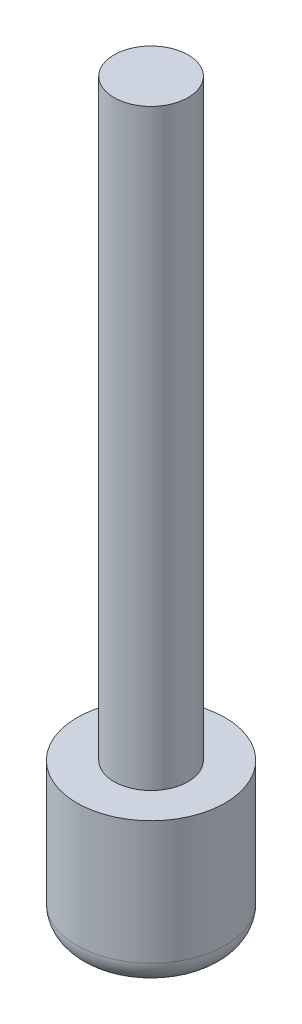
ISO-10303-21;
HEADER;
FILE_DESCRIPTION(('STEP AP214'),'2;1');
FILE_NAME('part.step','',(''),(''),'','','');
FILE_SCHEMA(('AUTOMOTIVE_DESIGN { 1 0 10303 214 1 1 1 1 }'));
ENDSEC;
DATA;
#1=APPLICATION_CONTEXT('core data for automotive mechanical design processes');
#2=APPLICATION_PROTOCOL_DEFINITION('international standard','automotive_design',2000,#1);
#3=PRODUCT_CONTEXT('',#1,'mechanical');
#4=PRODUCT('Part','Part','',(#3));
#5=PRODUCT_RELATED_PRODUCT_CATEGORY('part','',(#4));
#6=PRODUCT_DEFINITION_FORMATION('','',#4);
#7=PRODUCT_DEFINITION_CONTEXT('part definition',#1,'design');
#8=PRODUCT_DEFINITION('design','',#6,#7);
#9=PRODUCT_DEFINITION_SHAPE('','',#8);
#10=(LENGTH_UNIT() NAMED_UNIT(*) SI_UNIT(.MILLI.,.METRE.));
#11=(NAMED_UNIT(*) PLANE_ANGLE_UNIT() SI_UNIT($,.RADIAN.));
#12=(NAMED_UNIT(*) SI_UNIT($,.STERADIAN.) SOLID_ANGLE_UNIT());
#13=UNCERTAINTY_MEASURE_WITH_UNIT(LENGTH_MEASURE(1.E-05),#10,'distance_accuracy_value','');
#14=(GEOMETRIC_REPRESENTATION_CONTEXT(3) GLOBAL_UNCERTAINTY_ASSIGNED_CONTEXT((#13)) GLOBAL_UNIT_ASSIGNED_CONTEXT((#10,
#11,#12)) REPRESENTATION_CONTEXT('',''));
#15=CARTESIAN_POINT('',(0.,0.,0.));
#16=DIRECTION('',(0.,0.,1.));
#17=DIRECTION('',(1.,0.,0.));
#18=AXIS2_PLACEMENT_3D('',#15,#16,#17);
#19=CARTESIAN_POINT('',(0.,0.,0.));
#20=DIRECTION('',(0.,-1.,0.));
#21=DIRECTION('',(0.,0.,-1.));
#22=AXIS2_PLACEMENT_3D('',#19,#20,#21);
#23=PLANE('',#22);
#24=CARTESIAN_POINT('',(0.,0.,0.));
#25=DIRECTION('',(0.,-1.,0.));
#26=DIRECTION('',(0.,0.,-1.));
#27=AXIS2_PLACEMENT_3D('',#24,#25,#26);
#28=CIRCLE('',#27,50.7999999999998);
#29=CARTESIAN_POINT('',(0.,0.,-50.7999999999998));
#30=VERTEX_POINT('',#29);
#31=EDGE_CURVE('E54',#30,#30,#28,.T.);
#32=ORIENTED_EDGE('',*,*,#31,.T.);
#33=EDGE_LOOP('',(#32));
#34=FACE_BOUND('',#33,.T.);
#35=ADVANCED_FACE('F35',(#34),#23,.T.);
#36=CARTESIAN_POINT('',(0.,762.,0.));
#37=DIRECTION('',(0.,1.,0.));
#38=DIRECTION('',(0.,0.,1.));
#39=AXIS2_PLACEMENT_3D('',#36,#37,#38);
#40=PLANE('',#39);
#41=CARTESIAN_POINT('',(0.,762.,0.));
#42=DIRECTION('',(0.,-1.,0.));
#43=DIRECTION('',(0.,0.,-1.));
#44=AXIS2_PLACEMENT_3D('',#41,#42,#43);
#45=CIRCLE('',#44,38.1);
#46=CARTESIAN_POINT('',(0.,762.,-38.1));
#47=VERTEX_POINT('',#46);
#48=EDGE_CURVE('E10',#47,#47,#45,.T.);
#49=ORIENTED_EDGE('',*,*,#48,.F.);
#50=EDGE_LOOP('',(#49));
#51=FACE_BOUND('',#50,.T.);
#52=ADVANCED_FACE('F71',(#51),#40,.T.);
#53=CARTESIAN_POINT('',(0.,152.4,0.));
#54=DIRECTION('',(0.,-1.,0.));
#55=DIRECTION('',(0.,0.,-1.));
#56=AXIS2_PLACEMENT_3D('',#53,#54,#55);
#57=CYLINDRICAL_SURFACE('',#56,38.1);
#58=ORIENTED_EDGE('',*,*,#48,.T.);
#59=EDGE_LOOP('',(#58));
#60=FACE_BOUND('',#59,.T.);
#61=CARTESIAN_POINT('',(0.,152.4,0.));
#62=DIRECTION('',(0.,-1.,0.));
#63=DIRECTION('',(0.,0.,-1.));
#64=AXIS2_PLACEMENT_3D('',#61,#62,#63);
#65=CIRCLE('',#64,38.1);
#66=CARTESIAN_POINT('',(0.,152.4,-38.1));
#67=VERTEX_POINT('',#66);
#68=EDGE_CURVE('E41',#67,#67,#65,.T.);
#69=ORIENTED_EDGE('',*,*,#68,.F.);
#70=EDGE_LOOP('',(#69));
#71=FACE_BOUND('',#70,.T.);
#72=ADVANCED_FACE('F75',(#60,#71),#57,.T.);
#73=CARTESIAN_POINT('',(38.1,152.4,0.));
#74=DIRECTION('',(0.,1.,0.));
#75=DIRECTION('',(0.,0.,1.));
#76=AXIS2_PLACEMENT_3D('',#73,#74,#75);
#77=PLANE('',#76);
#78=ORIENTED_EDGE('',*,*,#68,.T.);
#79=EDGE_LOOP('',(#78));
#80=FACE_BOUND('',#79,.T.);
#81=CARTESIAN_POINT('',(0.,152.4,0.));
#82=DIRECTION('',(0.,-1.,0.));
#83=DIRECTION('',(0.,0.,-1.));
#84=AXIS2_PLACEMENT_3D('',#81,#82,#83);
#85=CIRCLE('',#84,76.2);
#86=CARTESIAN_POINT('',(0.,152.4,-76.2));
#87=VERTEX_POINT('',#86);
#88=EDGE_CURVE('E45',#87,#87,#85,.T.);
#89=ORIENTED_EDGE('',*,*,#88,.F.);
#90=EDGE_LOOP('',(#89));
#91=FACE_BOUND('',#90,.T.);
#92=ADVANCED_FACE('F67',(#80,#91),#77,.T.);
#93=CARTESIAN_POINT('',(0.,152.4,0.));
#94=DIRECTION('',(0.,-1.,0.));
#95=DIRECTION('',(0.,0.,-1.));
#96=AXIS2_PLACEMENT_3D('',#93,#94,#95);
#97=CYLINDRICAL_SURFACE('',#96,76.2);
#98=ORIENTED_EDGE('',*,*,#88,.T.);
#99=EDGE_LOOP('',(#98));
#100=FACE_BOUND('',#99,.T.);
#101=CARTESIAN_POINT('',(0.,25.4000000000002,0.));
#102=DIRECTION('',(0.,-1.,0.));
#103=DIRECTION('',(0.,0.,-1.));
#104=AXIS2_PLACEMENT_3D('',#101,#102,#103);
#105=CIRCLE('',#104,76.2);
#106=CARTESIAN_POINT('',(0.,25.4000000000002,-76.2));
#107=VERTEX_POINT('',#106);
#108=EDGE_CURVE('E49',#107,#107,#105,.T.);
#109=ORIENTED_EDGE('',*,*,#108,.F.);
#110=EDGE_LOOP('',(#109));
#111=FACE_BOUND('',#110,.T.);
#112=ADVANCED_FACE('F61',(#100,#111),#97,.T.);
#113=CARTESIAN_POINT('',(0.,25.4,0.));
#114=DIRECTION('',(0.,-1.,0.));
#115=DIRECTION('',(0.,0.,-1.));
#116=AXIS2_PLACEMENT_3D('',#113,#114,#115);
#117=TOROIDAL_SURFACE('',#116,50.8,25.4);
#118=ORIENTED_EDGE('',*,*,#108,.T.);
#119=EDGE_LOOP('',(#118));
#120=FACE_BOUND('',#119,.T.);
#121=ORIENTED_EDGE('',*,*,#31,.F.);
#122=EDGE_LOOP('',(#121));
#123=FACE_BOUND('',#122,.T.);
#124=ADVANCED_FACE('F59',(#120,#123),#117,.T.);
#125=CLOSED_SHELL('',(#35,#52,#72,#92,#112,#124));
#126=MANIFOLD_SOLID_BREP('B2',#125);
#127=ADVANCED_BREP_SHAPE_REPRESENTATION('',(#18,#126),#14);
#128=SHAPE_DEFINITION_REPRESENTATION(#9,#127);
ENDSEC;
END-ISO-10303-21;
